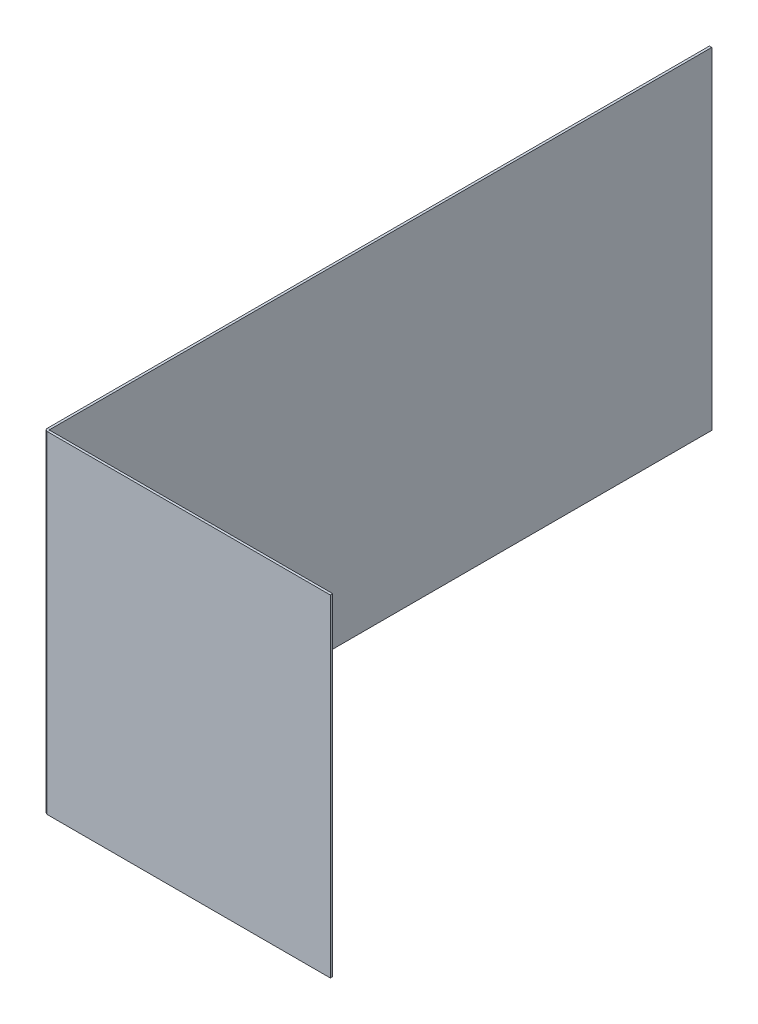
ISO-10303-21;
HEADER;
FILE_DESCRIPTION(('STEP AP214'),'2;1');
FILE_NAME('part.step','',(''),(''),'','','');
FILE_SCHEMA(('AUTOMOTIVE_DESIGN { 1 0 10303 214 1 1 1 1 }'));
ENDSEC;
DATA;
#1=APPLICATION_CONTEXT('core data for automotive mechanical design processes');
#2=APPLICATION_PROTOCOL_DEFINITION('international standard','automotive_design',2000,#1);
#3=PRODUCT_CONTEXT('',#1,'mechanical');
#4=PRODUCT('Part','Part','',(#3));
#5=PRODUCT_RELATED_PRODUCT_CATEGORY('part','',(#4));
#6=PRODUCT_DEFINITION_FORMATION('','',#4);
#7=PRODUCT_DEFINITION_CONTEXT('part definition',#1,'design');
#8=PRODUCT_DEFINITION('design','',#6,#7);
#9=PRODUCT_DEFINITION_SHAPE('','',#8);
#10=(LENGTH_UNIT() NAMED_UNIT(*) SI_UNIT(.MILLI.,.METRE.));
#11=(NAMED_UNIT(*) PLANE_ANGLE_UNIT() SI_UNIT($,.RADIAN.));
#12=(NAMED_UNIT(*) SI_UNIT($,.STERADIAN.) SOLID_ANGLE_UNIT());
#13=UNCERTAINTY_MEASURE_WITH_UNIT(LENGTH_MEASURE(1.E-05),#10,'distance_accuracy_value','');
#14=(GEOMETRIC_REPRESENTATION_CONTEXT(3) GLOBAL_UNCERTAINTY_ASSIGNED_CONTEXT((#13)) GLOBAL_UNIT_ASSIGNED_CONTEXT((#10,
#11,#12)) REPRESENTATION_CONTEXT('',''));
#15=CARTESIAN_POINT('',(0.,0.,0.));
#16=DIRECTION('',(0.,0.,1.));
#17=DIRECTION('',(1.,0.,0.));
#18=AXIS2_PLACEMENT_3D('',#15,#16,#17);
#19=CARTESIAN_POINT('',(305.230620045327,177.8,202.360620045326));
#20=DIRECTION('',(-1.,0.,0.));
#21=DIRECTION('',(0.,1.,0.));
#22=AXIS2_PLACEMENT_3D('',#19,#20,#21);
#23=PLANE('',#22);
#24=DIRECTION('',(0.,-1.,0.));
#25=VECTOR('',#24,1.);
#26=CARTESIAN_POINT('',(305.230620045327,177.8,204.900620045326));
#27=LINE('',#26,#25);
#28=CARTESIAN_POINT('',(305.230620045327,177.8,204.900620045326));
#29=VERTEX_POINT('',#28);
#30=CARTESIAN_POINT('',(305.230620045327,-177.8,204.900620045326));
#31=VERTEX_POINT('',#30);
#32=EDGE_CURVE('E72',#29,#31,#27,.T.);
#33=ORIENTED_EDGE('',*,*,#32,.T.);
#34=DIRECTION('',(0.,0.,1.));
#35=VECTOR('',#34,1.);
#36=CARTESIAN_POINT('',(305.230620045327,-177.8,202.360620045326));
#37=LINE('',#36,#35);
#38=CARTESIAN_POINT('',(305.230620045327,-177.8,202.360620045326));
#39=VERTEX_POINT('',#38);
#40=EDGE_CURVE('E162',#39,#31,#37,.T.);
#41=ORIENTED_EDGE('',*,*,#40,.F.);
#42=DIRECTION('',(0.,-1.,0.));
#43=VECTOR('',#42,1.);
#44=CARTESIAN_POINT('',(305.230620045327,177.8,202.360620045326));
#45=LINE('',#44,#43);
#46=CARTESIAN_POINT('',(305.230620045327,177.8,202.360620045326));
#47=VERTEX_POINT('',#46);
#48=EDGE_CURVE('E11',#47,#39,#45,.T.);
#49=ORIENTED_EDGE('',*,*,#48,.F.);
#50=DIRECTION('',(0.,0.,1.));
#51=VECTOR('',#50,1.);
#52=CARTESIAN_POINT('',(305.230620045327,177.8,202.360620045326));
#53=LINE('',#52,#51);
#54=EDGE_CURVE('E166',#47,#29,#53,.T.);
#55=ORIENTED_EDGE('',*,*,#54,.T.);
#56=EDGE_LOOP('',(#33,#41,#49,#55));
#57=FACE_BOUND('',#56,.T.);
#58=ADVANCED_FACE('F35',(#57),#23,.F.);
#59=CARTESIAN_POINT('',(305.230620045327,177.8,202.360620045326));
#60=DIRECTION('',(0.,-1.,0.));
#61=DIRECTION('',(-1.,0.,0.));
#62=AXIS2_PLACEMENT_3D('',#59,#60,#61);
#63=PLANE('',#62);
#64=DIRECTION('',(0.,0.,-1.));
#65=VECTOR('',#64,1.);
#66=CARTESIAN_POINT('',(2.00659999999997,177.8,202.360620045327));
#67=LINE('',#66,#65);
#68=CARTESIAN_POINT('',(2.00659999999995,177.8,204.900620045327));
#69=VERTEX_POINT('',#68);
#70=CARTESIAN_POINT('',(2.00659999999997,177.8,202.360620045327));
#71=VERTEX_POINT('',#70);
#72=EDGE_CURVE('E39',#69,#71,#67,.T.);
#73=ORIENTED_EDGE('',*,*,#72,.F.);
#74=DIRECTION('',(1.,0.,0.));
#75=VECTOR('',#74,1.);
#76=CARTESIAN_POINT('',(305.230620045327,177.8,204.900620045326));
#77=LINE('',#76,#75);
#78=EDGE_CURVE('E164',#69,#29,#77,.T.);
#79=ORIENTED_EDGE('',*,*,#78,.T.);
#80=ORIENTED_EDGE('',*,*,#54,.F.);
#81=DIRECTION('',(1.,0.,0.));
#82=VECTOR('',#81,1.);
#83=CARTESIAN_POINT('',(305.230620045327,177.8,202.360620045326));
#84=LINE('',#83,#82);
#85=EDGE_CURVE('E45',#71,#47,#84,.T.);
#86=ORIENTED_EDGE('',*,*,#85,.F.);
#87=EDGE_LOOP('',(#73,#79,#80,#86));
#88=FACE_BOUND('',#87,.T.);
#89=ADVANCED_FACE('F203',(#88),#63,.F.);
#90=CARTESIAN_POINT('',(-202.769379954673,0.,204.900620045327));
#91=DIRECTION('',(0.,0.,-1.));
#92=DIRECTION('',(-1.,0.,0.));
#93=AXIS2_PLACEMENT_3D('',#90,#91,#92);
#94=PLANE('',#93);
#95=DIRECTION('',(0.,1.,0.));
#96=VECTOR('',#95,1.);
#97=CARTESIAN_POINT('',(2.0066,0.,204.900620045327));
#98=LINE('',#97,#96);
#99=CARTESIAN_POINT('',(2.00660000000008,-177.8,204.900620045327));
#100=VERTEX_POINT('',#99);
#101=EDGE_CURVE('E169',#100,#69,#98,.T.);
#102=ORIENTED_EDGE('',*,*,#101,.F.);
#103=DIRECTION('',(-1.,0.,0.));
#104=VECTOR('',#103,1.);
#105=CARTESIAN_POINT('',(305.230620045327,-177.8,204.900620045326));
#106=LINE('',#105,#104);
#107=EDGE_CURVE('E160',#31,#100,#106,.T.);
#108=ORIENTED_EDGE('',*,*,#107,.F.);
#109=ORIENTED_EDGE('',*,*,#32,.F.);
#110=ORIENTED_EDGE('',*,*,#78,.F.);
#111=EDGE_LOOP('',(#102,#108,#109,#110));
#112=FACE_BOUND('',#111,.T.);
#113=ADVANCED_FACE('F200',(#112),#94,.F.);
#114=CARTESIAN_POINT('',(305.230620045327,-177.8,202.360620045326));
#115=DIRECTION('',(0.,1.,0.));
#116=DIRECTION('',(1.,0.,0.));
#117=AXIS2_PLACEMENT_3D('',#114,#115,#116);
#118=PLANE('',#117);
#119=DIRECTION('',(0.,0.,1.));
#120=VECTOR('',#119,1.);
#121=CARTESIAN_POINT('',(2.00659999999997,-177.8,202.360620045327));
#122=LINE('',#121,#120);
#123=CARTESIAN_POINT('',(2.00660000000008,-177.8,202.360620045327));
#124=VERTEX_POINT('',#123);
#125=EDGE_CURVE('E79',#124,#100,#122,.T.);
#126=ORIENTED_EDGE('',*,*,#125,.F.);
#127=DIRECTION('',(-1.,0.,0.));
#128=VECTOR('',#127,1.);
#129=CARTESIAN_POINT('',(305.230620045327,-177.8,202.360620045326));
#130=LINE('',#129,#128);
#131=EDGE_CURVE('E158',#39,#124,#130,.T.);
#132=ORIENTED_EDGE('',*,*,#131,.F.);
#133=ORIENTED_EDGE('',*,*,#40,.T.);
#134=ORIENTED_EDGE('',*,*,#107,.T.);
#135=EDGE_LOOP('',(#126,#132,#133,#134));
#136=FACE_BOUND('',#135,.T.);
#137=ADVANCED_FACE('F201',(#136),#118,.F.);
#138=CARTESIAN_POINT('',(-202.769379954673,0.,202.360620045328));
#139=DIRECTION('',(0.,0.,-1.));
#140=DIRECTION('',(-1.,0.,0.));
#141=AXIS2_PLACEMENT_3D('',#138,#139,#140);
#142=PLANE('',#141);
#143=ORIENTED_EDGE('',*,*,#131,.T.);
#144=DIRECTION('',(0.,1.,0.));
#145=VECTOR('',#144,1.);
#146=CARTESIAN_POINT('',(2.0066,0.,202.360620045327));
#147=LINE('',#146,#145);
#148=EDGE_CURVE('E156',#124,#71,#147,.T.);
#149=ORIENTED_EDGE('',*,*,#148,.T.);
#150=ORIENTED_EDGE('',*,*,#85,.T.);
#151=ORIENTED_EDGE('',*,*,#48,.T.);
#152=EDGE_LOOP('',(#143,#149,#150,#151));
#153=FACE_BOUND('',#152,.T.);
#154=ADVANCED_FACE('F37',(#153),#142,.T.);
#155=CARTESIAN_POINT('',(1.27,177.8,508.));
#156=DIRECTION('',(0.,-1.,0.));
#157=DIRECTION('',(0.,0.,-1.));
#158=AXIS2_PLACEMENT_3D('',#155,#156,#157);
#159=PLANE('',#158);
#160=DIRECTION('',(0.,0.,1.));
#161=VECTOR('',#160,1.);
#162=CARTESIAN_POINT('',(-1.27,177.8,508.));
#163=LINE('',#162,#161);
#164=CARTESIAN_POINT('',(-1.27,177.8,-508.));
#165=VERTEX_POINT('',#164);
#166=CARTESIAN_POINT('',(-1.27,177.8,201.624020045327));
#167=VERTEX_POINT('',#166);
#168=EDGE_CURVE('E121',#165,#167,#163,.T.);
#169=ORIENTED_EDGE('',*,*,#168,.T.);
#170=DIRECTION('',(1.,0.,0.));
#171=VECTOR('',#170,1.);
#172=CARTESIAN_POINT('',(1.26999999999998,177.8,201.624020045327));
#173=LINE('',#172,#171);
#174=CARTESIAN_POINT('',(1.27,177.8,201.624020045327));
#175=VERTEX_POINT('',#174);
#176=EDGE_CURVE('E146',#167,#175,#173,.T.);
#177=ORIENTED_EDGE('',*,*,#176,.T.);
#178=DIRECTION('',(0.,0.,1.));
#179=VECTOR('',#178,1.);
#180=CARTESIAN_POINT('',(1.27,177.8,508.));
#181=LINE('',#180,#179);
#182=CARTESIAN_POINT('',(1.27,177.8,-508.));
#183=VERTEX_POINT('',#182);
#184=EDGE_CURVE('E151',#183,#175,#181,.T.);
#185=ORIENTED_EDGE('',*,*,#184,.F.);
#186=DIRECTION('',(-1.,0.,0.));
#187=VECTOR('',#186,1.);
#188=CARTESIAN_POINT('',(1.27,177.8,-508.));
#189=LINE('',#188,#187);
#190=EDGE_CURVE('E128',#183,#165,#189,.T.);
#191=ORIENTED_EDGE('',*,*,#190,.T.);
#192=EDGE_LOOP('',(#169,#177,#185,#191));
#193=FACE_BOUND('',#192,.T.);
#194=ADVANCED_FACE('F190',(#193),#159,.F.);
#195=CARTESIAN_POINT('',(1.27,-177.8,508.));
#196=DIRECTION('',(0.,1.,0.));
#197=DIRECTION('',(0.,0.,1.));
#198=AXIS2_PLACEMENT_3D('',#195,#196,#197);
#199=PLANE('',#198);
#200=DIRECTION('',(0.,0.,-1.));
#201=VECTOR('',#200,1.);
#202=CARTESIAN_POINT('',(1.27,-177.8,508.));
#203=LINE('',#202,#201);
#204=CARTESIAN_POINT('',(1.27,-177.8,201.624020045327));
#205=VERTEX_POINT('',#204);
#206=CARTESIAN_POINT('',(1.27,-177.8,-508.));
#207=VERTEX_POINT('',#206);
#208=EDGE_CURVE('E95',#205,#207,#203,.T.);
#209=ORIENTED_EDGE('',*,*,#208,.F.);
#210=DIRECTION('',(-1.,0.,0.));
#211=VECTOR('',#210,1.);
#212=CARTESIAN_POINT('',(1.26999999999998,-177.8,201.624020045327));
#213=LINE('',#212,#211);
#214=CARTESIAN_POINT('',(-1.27,-177.8,201.624020045327));
#215=VERTEX_POINT('',#214);
#216=EDGE_CURVE('E116',#205,#215,#213,.T.);
#217=ORIENTED_EDGE('',*,*,#216,.T.);
#218=DIRECTION('',(0.,0.,-1.));
#219=VECTOR('',#218,1.);
#220=CARTESIAN_POINT('',(-1.27,-177.8,508.));
#221=LINE('',#220,#219);
#222=CARTESIAN_POINT('',(-1.27,-177.8,-508.));
#223=VERTEX_POINT('',#222);
#224=EDGE_CURVE('E109',#215,#223,#221,.T.);
#225=ORIENTED_EDGE('',*,*,#224,.T.);
#226=DIRECTION('',(-1.,0.,0.));
#227=VECTOR('',#226,1.);
#228=CARTESIAN_POINT('',(1.27,-177.8,-508.));
#229=LINE('',#228,#227);
#230=EDGE_CURVE('E112',#207,#223,#229,.T.);
#231=ORIENTED_EDGE('',*,*,#230,.F.);
#232=EDGE_LOOP('',(#209,#217,#225,#231));
#233=FACE_BOUND('',#232,.T.);
#234=ADVANCED_FACE('F111',(#233),#199,.F.);
#235=CARTESIAN_POINT('',(-1.27,0.,0.));
#236=DIRECTION('',(1.,0.,0.));
#237=DIRECTION('',(0.,0.,-1.));
#238=AXIS2_PLACEMENT_3D('',#235,#236,#237);
#239=PLANE('',#238);
#240=ORIENTED_EDGE('',*,*,#224,.F.);
#241=DIRECTION('',(0.,1.,0.));
#242=VECTOR('',#241,1.);
#243=CARTESIAN_POINT('',(-1.27,0.,201.624020045327));
#244=LINE('',#243,#242);
#245=EDGE_CURVE('E143',#215,#167,#244,.T.);
#246=ORIENTED_EDGE('',*,*,#245,.T.);
#247=ORIENTED_EDGE('',*,*,#168,.F.);
#248=DIRECTION('',(0.,1.,0.));
#249=VECTOR('',#248,1.);
#250=CARTESIAN_POINT('',(-1.27,177.8,-508.));
#251=LINE('',#250,#249);
#252=EDGE_CURVE('E127',#223,#165,#251,.T.);
#253=ORIENTED_EDGE('',*,*,#252,.F.);
#254=EDGE_LOOP('',(#240,#246,#247,#253));
#255=FACE_BOUND('',#254,.T.);
#256=ADVANCED_FACE('F130',(#255),#239,.F.);
#257=CARTESIAN_POINT('',(1.27,177.8,-508.));
#258=DIRECTION('',(0.,0.,1.));
#259=DIRECTION('',(0.,-1.,0.));
#260=AXIS2_PLACEMENT_3D('',#257,#258,#259);
#261=PLANE('',#260);
#262=ORIENTED_EDGE('',*,*,#252,.T.);
#263=ORIENTED_EDGE('',*,*,#190,.F.);
#264=DIRECTION('',(0.,1.,0.));
#265=VECTOR('',#264,1.);
#266=CARTESIAN_POINT('',(1.27,177.8,-508.));
#267=LINE('',#266,#265);
#268=EDGE_CURVE('E120',#207,#183,#267,.T.);
#269=ORIENTED_EDGE('',*,*,#268,.F.);
#270=ORIENTED_EDGE('',*,*,#230,.T.);
#271=EDGE_LOOP('',(#262,#263,#269,#270));
#272=FACE_BOUND('',#271,.T.);
#273=ADVANCED_FACE('F125',(#272),#261,.F.);
#274=CARTESIAN_POINT('',(1.27,0.,0.));
#275=DIRECTION('',(1.,0.,0.));
#276=DIRECTION('',(0.,0.,-1.));
#277=AXIS2_PLACEMENT_3D('',#274,#275,#276);
#278=PLANE('',#277);
#279=DIRECTION('',(0.,1.,0.));
#280=VECTOR('',#279,1.);
#281=CARTESIAN_POINT('',(1.27,0.,201.624020045327));
#282=LINE('',#281,#280);
#283=EDGE_CURVE('E149',#205,#175,#282,.T.);
#284=ORIENTED_EDGE('',*,*,#283,.F.);
#285=ORIENTED_EDGE('',*,*,#208,.T.);
#286=ORIENTED_EDGE('',*,*,#268,.T.);
#287=ORIENTED_EDGE('',*,*,#184,.T.);
#288=EDGE_LOOP('',(#284,#285,#286,#287));
#289=FACE_BOUND('',#288,.T.);
#290=ADVANCED_FACE('F188',(#289),#278,.T.);
#291=CARTESIAN_POINT('',(2.0066,177.8,201.624020045327));
#292=DIRECTION('',(0.,-1.,0.));
#293=DIRECTION('',(0.,0.,-1.));
#294=AXIS2_PLACEMENT_3D('',#291,#292,#293);
#295=PLANE('',#294);
#296=ORIENTED_EDGE('',*,*,#72,.T.);
#297=CARTESIAN_POINT('',(2.0066,177.8,201.624020045327));
#298=DIRECTION('',(0.,-1.,0.));
#299=DIRECTION('',(0.,0.,-1.));
#300=AXIS2_PLACEMENT_3D('',#297,#298,#299);
#301=CIRCLE('',#300,0.736600000000003);
#302=EDGE_CURVE('E86',#175,#71,#301,.F.);
#303=ORIENTED_EDGE('',*,*,#302,.F.);
#304=ORIENTED_EDGE('',*,*,#176,.F.);
#305=CARTESIAN_POINT('',(2.0066,177.8,201.624020045327));
#306=DIRECTION('',(0.,-1.,0.));
#307=DIRECTION('',(0.,0.,-1.));
#308=AXIS2_PLACEMENT_3D('',#305,#306,#307);
#309=CIRCLE('',#308,3.2766);
#310=EDGE_CURVE('E133',#167,#69,#309,.F.);
#311=ORIENTED_EDGE('',*,*,#310,.T.);
#312=EDGE_LOOP('',(#296,#303,#304,#311));
#313=FACE_BOUND('',#312,.T.);
#314=ADVANCED_FACE('F176',(#313),#295,.F.);
#315=CARTESIAN_POINT('',(2.0066,-177.8,201.624020045327));
#316=DIRECTION('',(0.,1.,0.));
#317=DIRECTION('',(0.,0.,1.));
#318=AXIS2_PLACEMENT_3D('',#315,#316,#317);
#319=PLANE('',#318);
#320=ORIENTED_EDGE('',*,*,#216,.F.);
#321=CARTESIAN_POINT('',(2.0066,-177.8,201.624020045327));
#322=DIRECTION('',(0.,-1.,0.));
#323=DIRECTION('',(0.,0.,-1.));
#324=AXIS2_PLACEMENT_3D('',#321,#322,#323);
#325=CIRCLE('',#324,0.736600000000003);
#326=EDGE_CURVE('E184',#124,#205,#325,.T.);
#327=ORIENTED_EDGE('',*,*,#326,.F.);
#328=ORIENTED_EDGE('',*,*,#125,.T.);
#329=CARTESIAN_POINT('',(2.0066,-177.8,201.624020045327));
#330=DIRECTION('',(0.,-1.,0.));
#331=DIRECTION('',(0.,0.,-1.));
#332=AXIS2_PLACEMENT_3D('',#329,#330,#331);
#333=CIRCLE('',#332,3.2766);
#334=EDGE_CURVE('E137',#100,#215,#333,.T.);
#335=ORIENTED_EDGE('',*,*,#334,.T.);
#336=EDGE_LOOP('',(#320,#327,#328,#335));
#337=FACE_BOUND('',#336,.T.);
#338=ADVANCED_FACE('F281',(#337),#319,.F.);
#339=CARTESIAN_POINT('',(2.0066,1254.2356978473,201.624020045327));
#340=DIRECTION('',(0.,-1.,0.));
#341=DIRECTION('',(0.,0.,-1.));
#342=AXIS2_PLACEMENT_3D('',#339,#340,#341);
#343=CYLINDRICAL_SURFACE('',#342,3.2766);
#344=ORIENTED_EDGE('',*,*,#334,.F.);
#345=ORIENTED_EDGE('',*,*,#101,.T.);
#346=ORIENTED_EDGE('',*,*,#310,.F.);
#347=ORIENTED_EDGE('',*,*,#245,.F.);
#348=EDGE_LOOP('',(#344,#345,#346,#347));
#349=FACE_BOUND('',#348,.T.);
#350=ADVANCED_FACE('F195',(#349),#343,.T.);
#351=CARTESIAN_POINT('',(2.0066,1254.2356978473,201.624020045327));
#352=DIRECTION('',(0.,-1.,0.));
#353=DIRECTION('',(0.,0.,-1.));
#354=AXIS2_PLACEMENT_3D('',#351,#352,#353);
#355=CYLINDRICAL_SURFACE('',#354,0.736600000000003);
#356=ORIENTED_EDGE('',*,*,#326,.T.);
#357=ORIENTED_EDGE('',*,*,#283,.T.);
#358=ORIENTED_EDGE('',*,*,#302,.T.);
#359=ORIENTED_EDGE('',*,*,#148,.F.);
#360=EDGE_LOOP('',(#356,#357,#358,#359));
#361=FACE_BOUND('',#360,.T.);
#362=ADVANCED_FACE('F183',(#361),#355,.F.);
#363=CLOSED_SHELL('',(#58,#89,#113,#137,#154,#194,#234,#256,#273,#290,#314,#338,#350,#362));
#364=MANIFOLD_SOLID_BREP('B2',#363);
#365=ADVANCED_BREP_SHAPE_REPRESENTATION('',(#18,#364),#14);
#366=SHAPE_DEFINITION_REPRESENTATION(#9,#365);
ENDSEC;
END-ISO-10303-21;
